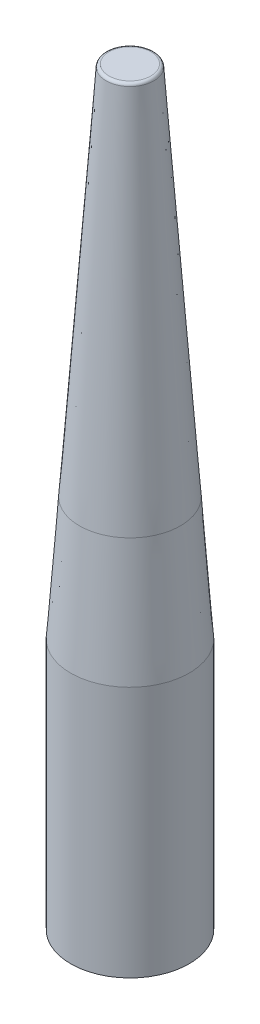
ISO-10303-21;
HEADER;
FILE_DESCRIPTION(('STEP AP214'),'2;1');
FILE_NAME('part.step','',(''),(''),'','','');
FILE_SCHEMA(('AUTOMOTIVE_DESIGN { 1 0 10303 214 1 1 1 1 }'));
ENDSEC;
DATA;
#1=APPLICATION_CONTEXT('core data for automotive mechanical design processes');
#2=APPLICATION_PROTOCOL_DEFINITION('international standard','automotive_design',2000,#1);
#3=PRODUCT_CONTEXT('',#1,'mechanical');
#4=PRODUCT('Part','Part','',(#3));
#5=PRODUCT_RELATED_PRODUCT_CATEGORY('part','',(#4));
#6=PRODUCT_DEFINITION_FORMATION('','',#4);
#7=PRODUCT_DEFINITION_CONTEXT('part definition',#1,'design');
#8=PRODUCT_DEFINITION('design','',#6,#7);
#9=PRODUCT_DEFINITION_SHAPE('','',#8);
#10=(LENGTH_UNIT() NAMED_UNIT(*) SI_UNIT(.MILLI.,.METRE.));
#11=(NAMED_UNIT(*) PLANE_ANGLE_UNIT() SI_UNIT($,.RADIAN.));
#12=(NAMED_UNIT(*) SI_UNIT($,.STERADIAN.) SOLID_ANGLE_UNIT());
#13=UNCERTAINTY_MEASURE_WITH_UNIT(LENGTH_MEASURE(1.E-05),#10,'distance_accuracy_value','');
#14=(GEOMETRIC_REPRESENTATION_CONTEXT(3) GLOBAL_UNCERTAINTY_ASSIGNED_CONTEXT((#13)) GLOBAL_UNIT_ASSIGNED_CONTEXT((#10,
#11,#12)) REPRESENTATION_CONTEXT('',''));
#15=CARTESIAN_POINT('',(0.,0.,0.));
#16=DIRECTION('',(0.,0.,1.));
#17=DIRECTION('',(1.,0.,0.));
#18=AXIS2_PLACEMENT_3D('',#15,#16,#17);
#19=CARTESIAN_POINT('',(0.,160.655,0.));
#20=DIRECTION('',(0.,1.,0.));
#21=DIRECTION('',(-1.,0.,0.));
#22=AXIS2_PLACEMENT_3D('',#19,#20,#21);
#23=PLANE('',#22);
#24=CARTESIAN_POINT('',(0.,160.655,0.));
#25=DIRECTION('',(0.,1.,0.));
#26=DIRECTION('',(-1.,0.,0.));
#27=AXIS2_PLACEMENT_3D('',#24,#25,#26);
#28=CIRCLE('',#27,10.16);
#29=CARTESIAN_POINT('',(-10.16,160.655,0.));
#30=VERTEX_POINT('',#29);
#31=EDGE_CURVE('E11',#30,#30,#28,.T.);
#32=ORIENTED_EDGE('',*,*,#31,.F.);
#33=EDGE_LOOP('',(#32));
#34=FACE_BOUND('',#33,.T.);
#35=CARTESIAN_POINT('',(0.,160.655,0.));
#36=DIRECTION('',(0.,1.,0.));
#37=DIRECTION('',(-1.,0.,0.));
#38=AXIS2_PLACEMENT_3D('',#35,#36,#37);
#39=CIRCLE('',#38,21.631150766613);
#40=CARTESIAN_POINT('',(-21.631150766613,160.655,0.));
#41=VERTEX_POINT('',#40);
#42=EDGE_CURVE('E59',#41,#41,#39,.T.);
#43=ORIENTED_EDGE('',*,*,#42,.T.);
#44=EDGE_LOOP('',(#43));
#45=FACE_BOUND('',#44,.T.);
#46=ADVANCED_FACE('F55',(#34,#45),#23,.T.);
#47=CARTESIAN_POINT('',(0.,107.891110732582,0.));
#48=DIRECTION('',(0.,-1.,0.));
#49=DIRECTION('',(1.,0.,0.));
#50=AXIS2_PLACEMENT_3D('',#47,#48,#49);
#51=CONICAL_SURFACE('',#50,25.4,0.0713074647852903);
#52=CARTESIAN_POINT('',(0.,107.891110732582,0.));
#53=DIRECTION('',(0.,1.,0.));
#54=DIRECTION('',(-1.,0.,0.));
#55=AXIS2_PLACEMENT_3D('',#52,#53,#54);
#56=CIRCLE('',#55,25.4);
#57=CARTESIAN_POINT('',(-25.4,107.891110732582,0.));
#58=VERTEX_POINT('',#57);
#59=EDGE_CURVE('E68',#58,#58,#56,.T.);
#60=ORIENTED_EDGE('',*,*,#59,.T.);
#61=EDGE_LOOP('',(#60));
#62=FACE_BOUND('',#61,.T.);
#63=ORIENTED_EDGE('',*,*,#42,.F.);
#64=EDGE_LOOP('',(#63));
#65=FACE_BOUND('',#64,.T.);
#66=ADVANCED_FACE('F57',(#62,#65),#51,.T.);
#67=CARTESIAN_POINT('',(0.,321.31,0.));
#68=DIRECTION('',(0.,1.,0.));
#69=DIRECTION('',(-1.,0.,0.));
#70=AXIS2_PLACEMENT_3D('',#67,#68,#69);
#71=CYLINDRICAL_SURFACE('',#70,25.4);
#72=ORIENTED_EDGE('',*,*,#59,.F.);
#73=EDGE_LOOP('',(#72));
#74=FACE_BOUND('',#73,.T.);
#75=CARTESIAN_POINT('',(0.,0.,0.));
#76=DIRECTION('',(0.,1.,0.));
#77=DIRECTION('',(-1.,0.,0.));
#78=AXIS2_PLACEMENT_3D('',#75,#76,#77);
#79=CIRCLE('',#78,25.4);
#80=CARTESIAN_POINT('',(-25.4,0.,0.));
#81=VERTEX_POINT('',#80);
#82=EDGE_CURVE('E63',#81,#81,#79,.T.);
#83=ORIENTED_EDGE('',*,*,#82,.T.);
#84=EDGE_LOOP('',(#83));
#85=FACE_BOUND('',#84,.T.);
#86=ADVANCED_FACE('F92',(#74,#85),#71,.T.);
#87=CARTESIAN_POINT('',(0.,0.,0.));
#88=DIRECTION('',(0.,1.,0.));
#89=DIRECTION('',(-1.,0.,0.));
#90=AXIS2_PLACEMENT_3D('',#87,#88,#89);
#91=PLANE('',#90);
#92=ORIENTED_EDGE('',*,*,#82,.F.);
#93=EDGE_LOOP('',(#92));
#94=FACE_BOUND('',#93,.T.);
#95=ADVANCED_FACE('F85',(#94),#91,.F.);
#96=CARTESIAN_POINT('',(0.,173.355,0.));
#97=DIRECTION('',(0.,-1.,0.));
#98=DIRECTION('',(1.,0.,0.));
#99=AXIS2_PLACEMENT_3D('',#96,#97,#98);
#100=CYLINDRICAL_SURFACE('',#99,10.16);
#101=CARTESIAN_POINT('',(0.,173.355,0.));
#102=DIRECTION('',(0.,1.,0.));
#103=DIRECTION('',(-1.,0.,0.));
#104=AXIS2_PLACEMENT_3D('',#101,#102,#103);
#105=CIRCLE('',#104,10.16);
#106=CARTESIAN_POINT('',(-10.16,173.355,0.));
#107=VERTEX_POINT('',#106);
#108=EDGE_CURVE('E71',#107,#107,#105,.T.);
#109=ORIENTED_EDGE('',*,*,#108,.F.);
#110=EDGE_LOOP('',(#109));
#111=FACE_BOUND('',#110,.T.);
#112=ORIENTED_EDGE('',*,*,#31,.T.);
#113=EDGE_LOOP('',(#112));
#114=FACE_BOUND('',#113,.T.);
#115=ADVANCED_FACE('F83',(#111,#114),#100,.T.);
#116=CARTESIAN_POINT('',(0.,173.355,0.));
#117=DIRECTION('',(0.,1.,0.));
#118=DIRECTION('',(-1.,0.,0.));
#119=AXIS2_PLACEMENT_3D('',#116,#117,#118);
#120=PLANE('',#119);
#121=ORIENTED_EDGE('',*,*,#108,.T.);
#122=EDGE_LOOP('',(#121));
#123=FACE_BOUND('',#122,.T.);
#124=ADVANCED_FACE('F81',(#123),#120,.T.);
#125=CLOSED_SHELL('',(#46,#66,#86,#95,#115,#124));
#126=MANIFOLD_SOLID_BREP('B2',#125);
#127=CARTESIAN_POINT('',(0.,160.655,0.));
#128=DIRECTION('',(0.,1.,0.));
#129=DIRECTION('',(-1.,0.,0.));
#130=AXIS2_PLACEMENT_3D('',#127,#128,#129);
#131=PLANE('',#130);
#132=CARTESIAN_POINT('',(0.,160.655,0.));
#133=DIRECTION('',(0.,1.,0.));
#134=DIRECTION('',(-1.,0.,0.));
#135=AXIS2_PLACEMENT_3D('',#132,#133,#134);
#136=CIRCLE('',#135,11.4935);
#137=CARTESIAN_POINT('',(-11.4935,160.655,0.));
#138=VERTEX_POINT('',#137);
#139=EDGE_CURVE('E54',#138,#138,#136,.T.);
#140=ORIENTED_EDGE('',*,*,#139,.T.);
#141=EDGE_LOOP('',(#140));
#142=FACE_BOUND('',#141,.T.);
#143=CARTESIAN_POINT('',(0.,160.655,0.));
#144=DIRECTION('',(0.,1.,0.));
#145=DIRECTION('',(-1.,0.,0.));
#146=AXIS2_PLACEMENT_3D('',#143,#144,#145);
#147=CIRCLE('',#146,21.631150766613);
#148=CARTESIAN_POINT('',(-21.631150766613,160.655,0.));
#149=VERTEX_POINT('',#148);
#150=EDGE_CURVE('E168',#149,#149,#147,.T.);
#151=ORIENTED_EDGE('',*,*,#150,.F.);
#152=EDGE_LOOP('',(#151));
#153=FACE_BOUND('',#152,.T.);
#154=ADVANCED_FACE('F154',(#142,#153),#131,.F.);
#155=CARTESIAN_POINT('',(0.,321.31,0.));
#156=DIRECTION('',(0.,-1.,0.));
#157=DIRECTION('',(1.,0.,0.));
#158=AXIS2_PLACEMENT_3D('',#155,#156,#157);
#159=PLANE('',#158);
#160=CARTESIAN_POINT('',(0.,321.31,0.));
#161=DIRECTION('',(0.,-1.,0.));
#162=DIRECTION('',(1.,0.,0.));
#163=AXIS2_PLACEMENT_3D('',#160,#161,#162);
#164=CIRCLE('',#163,8.97327223543624);
#165=CARTESIAN_POINT('',(8.97327223543623,321.31,0.));
#166=VERTEX_POINT('',#165);
#167=EDGE_CURVE('E179',#166,#166,#164,.F.);
#168=ORIENTED_EDGE('',*,*,#167,.T.);
#169=EDGE_LOOP('',(#168));
#170=FACE_BOUND('',#169,.T.);
#171=ADVANCED_FACE('F194',(#170),#159,.F.);
#172=CARTESIAN_POINT('',(0.,320.04,0.));
#173=DIRECTION('',(0.,-1.,0.));
#174=DIRECTION('',(1.,0.,0.));
#175=AXIS2_PLACEMENT_3D('',#172,#173,#174);
#176=TOROIDAL_SURFACE('',#175,8.97327223543624,1.27);
#177=CARTESIAN_POINT('',(0.,320.130483753484,0.));
#178=DIRECTION('',(0.,1.,0.));
#179=DIRECTION('',(-1.,0.,0.));
#180=AXIS2_PLACEMENT_3D('',#177,#178,#179);
#181=CIRCLE('',#180,10.2400447842213);
#182=CARTESIAN_POINT('',(-10.2400447842213,320.130483753484,0.));
#183=VERTEX_POINT('',#182);
#184=EDGE_CURVE('E173',#183,#183,#181,.F.);
#185=ORIENTED_EDGE('',*,*,#184,.F.);
#186=EDGE_LOOP('',(#185));
#187=FACE_BOUND('',#186,.T.);
#188=ORIENTED_EDGE('',*,*,#167,.F.);
#189=EDGE_LOOP('',(#188));
#190=FACE_BOUND('',#189,.T.);
#191=ADVANCED_FACE('F200',(#187,#190),#176,.T.);
#192=CARTESIAN_POINT('',(0.,107.891110732582,0.));
#193=DIRECTION('',(0.,-1.,0.));
#194=DIRECTION('',(1.,0.,0.));
#195=AXIS2_PLACEMENT_3D('',#192,#193,#194);
#196=CONICAL_SURFACE('',#195,25.4,0.0713074647852903);
#197=ORIENTED_EDGE('',*,*,#150,.T.);
#198=EDGE_LOOP('',(#197));
#199=FACE_BOUND('',#198,.T.);
#200=ORIENTED_EDGE('',*,*,#184,.T.);
#201=EDGE_LOOP('',(#200));
#202=FACE_BOUND('',#201,.T.);
#203=ADVANCED_FACE('F192',(#199,#202),#196,.T.);
#204=CARTESIAN_POINT('',(0.,174.625,0.));
#205=DIRECTION('',(0.,-1.,0.));
#206=DIRECTION('',(1.,0.,0.));
#207=AXIS2_PLACEMENT_3D('',#204,#205,#206);
#208=CYLINDRICAL_SURFACE('',#207,10.2235);
#209=CARTESIAN_POINT('',(0.,161.925,0.));
#210=DIRECTION('',(0.,1.,0.));
#211=DIRECTION('',(-1.,0.,0.));
#212=AXIS2_PLACEMENT_3D('',#209,#210,#211);
#213=CIRCLE('',#212,10.2235);
#214=CARTESIAN_POINT('',(-10.2235,161.925,0.));
#215=VERTEX_POINT('',#214);
#216=EDGE_CURVE('E163',#215,#215,#213,.F.);
#217=ORIENTED_EDGE('',*,*,#216,.T.);
#218=EDGE_LOOP('',(#217));
#219=FACE_BOUND('',#218,.T.);
#220=CARTESIAN_POINT('',(0.,174.625,0.));
#221=DIRECTION('',(0.,-1.,0.));
#222=DIRECTION('',(1.,0.,0.));
#223=AXIS2_PLACEMENT_3D('',#220,#221,#222);
#224=CIRCLE('',#223,10.2235);
#225=CARTESIAN_POINT('',(10.2235,174.625,0.));
#226=VERTEX_POINT('',#225);
#227=EDGE_CURVE('E183',#226,#226,#224,.T.);
#228=ORIENTED_EDGE('',*,*,#227,.F.);
#229=EDGE_LOOP('',(#228));
#230=FACE_BOUND('',#229,.T.);
#231=ADVANCED_FACE('F190',(#219,#230),#208,.F.);
#232=CARTESIAN_POINT('',(0.,174.625,0.));
#233=DIRECTION('',(0.,-1.,0.));
#234=DIRECTION('',(1.,0.,0.));
#235=AXIS2_PLACEMENT_3D('',#232,#233,#234);
#236=PLANE('',#235);
#237=ORIENTED_EDGE('',*,*,#227,.T.);
#238=EDGE_LOOP('',(#237));
#239=FACE_BOUND('',#238,.T.);
#240=ADVANCED_FACE('F188',(#239),#236,.T.);
#241=CARTESIAN_POINT('',(0.,161.925,0.));
#242=DIRECTION('',(0.,-1.,0.));
#243=DIRECTION('',(1.,0.,0.));
#244=AXIS2_PLACEMENT_3D('',#241,#242,#243);
#245=CONICAL_SURFACE('',#244,10.2235,0.785398163397452);
#246=ORIENTED_EDGE('',*,*,#139,.F.);
#247=EDGE_LOOP('',(#246));
#248=FACE_BOUND('',#247,.T.);
#249=ORIENTED_EDGE('',*,*,#216,.F.);
#250=EDGE_LOOP('',(#249));
#251=FACE_BOUND('',#250,.T.);
#252=ADVANCED_FACE('F157',(#248,#251),#245,.F.);
#253=CLOSED_SHELL('',(#154,#171,#191,#203,#231,#240,#252));
#254=MANIFOLD_SOLID_BREP('B6_NOT_SHOWN',#253);
#255=ADVANCED_BREP_SHAPE_REPRESENTATION('',(#18,#126,#254),#14);
#256=SHAPE_DEFINITION_REPRESENTATION(#9,#255);
ENDSEC;
END-ISO-10303-21;
